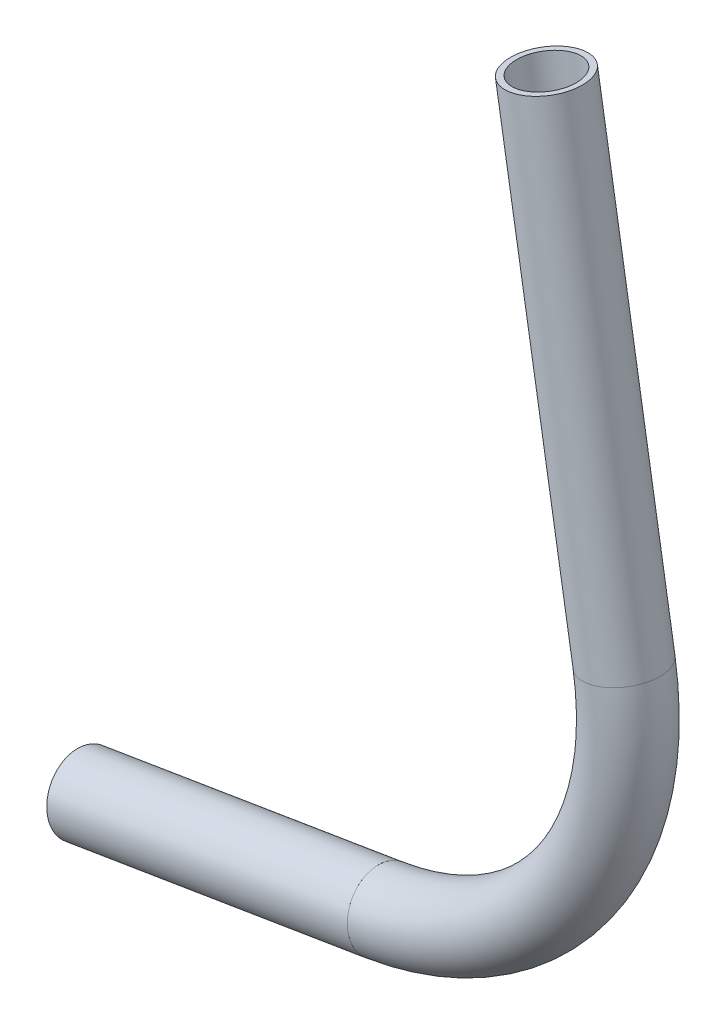
ISO-10303-21;
HEADER;
FILE_DESCRIPTION(('STEP AP214'),'2;1');
FILE_NAME('part.step','',(''),(''),'','','');
FILE_SCHEMA(('AUTOMOTIVE_DESIGN { 1 0 10303 214 1 1 1 1 }'));
ENDSEC;
DATA;
#1=APPLICATION_CONTEXT('core data for automotive mechanical design processes');
#2=APPLICATION_PROTOCOL_DEFINITION('international standard','automotive_design',2000,#1);
#3=PRODUCT_CONTEXT('',#1,'mechanical');
#4=PRODUCT('Part','Part','',(#3));
#5=PRODUCT_RELATED_PRODUCT_CATEGORY('part','',(#4));
#6=PRODUCT_DEFINITION_FORMATION('','',#4);
#7=PRODUCT_DEFINITION_CONTEXT('part definition',#1,'design');
#8=PRODUCT_DEFINITION('design','',#6,#7);
#9=PRODUCT_DEFINITION_SHAPE('','',#8);
#10=(LENGTH_UNIT() NAMED_UNIT(*) SI_UNIT(.MILLI.,.METRE.));
#11=(NAMED_UNIT(*) PLANE_ANGLE_UNIT() SI_UNIT($,.RADIAN.));
#12=(NAMED_UNIT(*) SI_UNIT($,.STERADIAN.) SOLID_ANGLE_UNIT());
#13=UNCERTAINTY_MEASURE_WITH_UNIT(LENGTH_MEASURE(1.E-05),#10,'distance_accuracy_value','');
#14=(GEOMETRIC_REPRESENTATION_CONTEXT(3) GLOBAL_UNCERTAINTY_ASSIGNED_CONTEXT((#13)) GLOBAL_UNIT_ASSIGNED_CONTEXT((#10,
#11,#12)) REPRESENTATION_CONTEXT('',''));
#15=CARTESIAN_POINT('',(0.,0.,0.));
#16=DIRECTION('',(0.,0.,1.));
#17=DIRECTION('',(1.,0.,0.));
#18=AXIS2_PLACEMENT_3D('',#15,#16,#17);
#19=CARTESIAN_POINT('',(152.119261375843,641.808809150247,0.));
#20=DIRECTION('',(-0.986819695995303,-0.161823631141246,0.));
#21=DIRECTION('',(0.161823631141246,-0.986819695995303,0.));
#22=AXIS2_PLACEMENT_3D('',#19,#20,#21);
#23=CYLINDRICAL_SURFACE('',#22,5.28320000000002);
#24=CARTESIAN_POINT('',(99.6262267896413,633.200738698436,0.));
#25=DIRECTION('',(0.986819695995303,0.161823631141246,0.));
#26=DIRECTION('',(-0.161823631141246,0.986819695995303,0.));
#27=AXIS2_PLACEMENT_3D('',#24,#25,#26);
#28=CIRCLE('',#27,5.28320000000002);
#29=CARTESIAN_POINT('',(98.7712801815959,638.414304516318,0.));
#30=VERTEX_POINT('',#29);
#31=EDGE_CURVE('E54',#30,#30,#28,.T.);
#32=ORIENTED_EDGE('',*,*,#31,.F.);
#33=EDGE_LOOP('',(#32));
#34=FACE_BOUND('',#33,.T.);
#35=CARTESIAN_POINT('',(152.119261375843,641.808809150247,0.));
#36=DIRECTION('',(0.986819695995303,0.161823631141246,0.));
#37=DIRECTION('',(-0.161823631141246,0.986819695995303,0.));
#38=AXIS2_PLACEMENT_3D('',#35,#36,#37);
#39=CIRCLE('',#38,5.28320000000002);
#40=CARTESIAN_POINT('',(151.264314767798,647.022374968129,0.));
#41=VERTEX_POINT('',#40);
#42=EDGE_CURVE('E50',#41,#41,#39,.T.);
#43=ORIENTED_EDGE('',*,*,#42,.T.);
#44=EDGE_LOOP('',(#43));
#45=FACE_BOUND('',#44,.T.);
#46=ADVANCED_FACE('F46',(#34,#45),#23,.F.);
#47=CARTESIAN_POINT('',(152.119261375843,641.808809150247,0.));
#48=DIRECTION('',(-0.986819695995303,-0.161823631141246,0.));
#49=DIRECTION('',(0.161823631141246,-0.986819695995303,0.));
#50=AXIS2_PLACEMENT_3D('',#47,#48,#49);
#51=CYLINDRICAL_SURFACE('',#50,6.35);
#52=CARTESIAN_POINT('',(99.6262267896413,633.200738698436,0.));
#53=DIRECTION('',(0.986819695995303,0.161823631141246,0.));
#54=DIRECTION('',(-0.161823631141246,0.986819695995303,0.));
#55=AXIS2_PLACEMENT_3D('',#52,#53,#54);
#56=CIRCLE('',#55,6.35);
#57=CARTESIAN_POINT('',(98.5986467318944,639.467043768006,0.));
#58=VERTEX_POINT('',#57);
#59=EDGE_CURVE('E58',#58,#58,#56,.T.);
#60=ORIENTED_EDGE('',*,*,#59,.T.);
#61=EDGE_LOOP('',(#60));
#62=FACE_BOUND('',#61,.T.);
#63=CARTESIAN_POINT('',(152.119261375843,641.808809150247,0.));
#64=DIRECTION('',(0.986819695995303,0.161823631141246,0.));
#65=DIRECTION('',(-0.161823631141246,0.986819695995303,0.));
#66=AXIS2_PLACEMENT_3D('',#63,#64,#65);
#67=CIRCLE('',#66,6.35);
#68=CARTESIAN_POINT('',(151.091681318096,648.075114219817,0.));
#69=VERTEX_POINT('',#68);
#70=EDGE_CURVE('E12',#69,#69,#67,.T.);
#71=ORIENTED_EDGE('',*,*,#70,.F.);
#72=EDGE_LOOP('',(#71));
#73=FACE_BOUND('',#72,.T.);
#74=ADVANCED_FACE('F73',(#62,#73),#51,.T.);
#75=CARTESIAN_POINT('',(99.6262267896413,633.200738698436,0.));
#76=DIRECTION('',(0.986819695995303,0.161823631141246,0.));
#77=DIRECTION('',(-0.161823631141246,0.986819695995303,0.));
#78=AXIS2_PLACEMENT_3D('',#75,#76,#77);
#79=PLANE('',#78);
#80=ORIENTED_EDGE('',*,*,#31,.T.);
#81=EDGE_LOOP('',(#80));
#82=FACE_BOUND('',#81,.T.);
#83=ORIENTED_EDGE('',*,*,#59,.F.);
#84=EDGE_LOOP('',(#83));
#85=FACE_BOUND('',#84,.T.);
#86=ADVANCED_FACE('F69',(#82,#85),#79,.F.);
#87=CARTESIAN_POINT('',(152.119261375843,641.808809150247,0.));
#88=DIRECTION('',(0.986819695995303,0.161823631141246,0.));
#89=DIRECTION('',(-0.161823631141246,0.986819695995303,0.));
#90=AXIS2_PLACEMENT_3D('',#87,#88,#89);
#91=PLANE('',#90);
#92=ORIENTED_EDGE('',*,*,#42,.F.);
#93=EDGE_LOOP('',(#92));
#94=FACE_BOUND('',#93,.T.);
#95=ORIENTED_EDGE('',*,*,#70,.T.);
#96=EDGE_LOOP('',(#95));
#97=FACE_BOUND('',#96,.T.);
#98=ADVANCED_FACE('F48',(#94,#97),#91,.T.);
#99=CLOSED_SHELL('',(#46,#74,#86,#98));
#100=MANIFOLD_SOLID_BREP('B2',#99);
#101=CARTESIAN_POINT('',(143.898620913868,691.939249706808,0.));
#102=DIRECTION('',(0.,0.,-1.));
#103=DIRECTION('',(-1.,0.,0.));
#104=AXIS2_PLACEMENT_3D('',#101,#102,#103);
#105=TOROIDAL_SURFACE('',#104,50.7999999999998,5.28320000000002);
#106=CARTESIAN_POINT('',(194.029061470429,700.159890168784,0.));
#107=DIRECTION('',(-0.161823631141257,0.986819695995301,0.));
#108=DIRECTION('',(-0.986819695995301,-0.161823631141257,0.));
#109=AXIS2_PLACEMENT_3D('',#106,#107,#108);
#110=CIRCLE('',#109,5.28320000000002);
#111=CARTESIAN_POINT('',(199.242627288312,701.014836776829,0.));
#112=VERTEX_POINT('',#111);
#113=EDGE_CURVE('E149',#112,#112,#110,.T.);
#114=CARTESIAN_POINT('',(152.119261375843,641.808809150247,0.));
#115=DIRECTION('',(-0.986819695995303,-0.161823631141246,0.));
#116=DIRECTION('',(0.161823631141246,-0.986819695995303,0.));
#117=AXIS2_PLACEMENT_3D('',#114,#115,#116);
#118=CIRCLE('',#117,5.28320000000002);
#119=CARTESIAN_POINT('',(152.974207983889,636.595243332364,0.));
#120=VERTEX_POINT('',#119);
#121=EDGE_CURVE('E139',#120,#120,#118,.T.);
#122=CARTESIAN_POINT('',(143.898620913868,691.939249706808,0.));
#123=DIRECTION('',(0.,0.,-1.));
#124=DIRECTION('',(-1.,0.,0.));
#125=AXIS2_PLACEMENT_3D('',#122,#123,#124);
#126=CIRCLE('',#125,56.0831999999998);
#127=EDGE_CURVE('',#112,#120,#126,.T.);
#128=ORIENTED_EDGE('',*,*,#113,.T.);
#129=ORIENTED_EDGE('',*,*,#121,.T.);
#130=ORIENTED_EDGE('',*,*,#127,.T.);
#131=ORIENTED_EDGE('',*,*,#127,.F.);
#132=EDGE_LOOP('',(#128,#130,#129,#131));
#133=FACE_BOUND('',#132,.T.);
#134=ADVANCED_FACE('F135',(#133),#105,.F.);
#135=CARTESIAN_POINT('',(143.898620913868,691.939249706808,0.));
#136=DIRECTION('',(0.,0.,-1.));
#137=DIRECTION('',(-1.,0.,0.));
#138=AXIS2_PLACEMENT_3D('',#135,#136,#137);
#139=TOROIDAL_SURFACE('',#138,50.7999999999998,6.35);
#140=CARTESIAN_POINT('',(194.029061470429,700.159890168784,0.));
#141=DIRECTION('',(-0.161823631141257,0.986819695995301,0.));
#142=DIRECTION('',(-0.986819695995301,-0.161823631141257,0.));
#143=AXIS2_PLACEMENT_3D('',#140,#141,#142);
#144=CIRCLE('',#143,6.35);
#145=CARTESIAN_POINT('',(200.295366539999,701.187470226531,0.));
#146=VERTEX_POINT('',#145);
#147=EDGE_CURVE('E143',#146,#146,#144,.T.);
#148=CARTESIAN_POINT('',(152.119261375843,641.808809150247,0.));
#149=DIRECTION('',(-0.986819695995303,-0.161823631141246,0.));
#150=DIRECTION('',(0.161823631141246,-0.986819695995303,0.));
#151=AXIS2_PLACEMENT_3D('',#148,#149,#150);
#152=CIRCLE('',#151,6.35);
#153=CARTESIAN_POINT('',(153.14684143359,635.542504080677,0.));
#154=VERTEX_POINT('',#153);
#155=EDGE_CURVE('E45',#154,#154,#152,.T.);
#156=CARTESIAN_POINT('',(143.898620913868,691.939249706808,0.));
#157=DIRECTION('',(0.,0.,-1.));
#158=DIRECTION('',(-1.,0.,0.));
#159=AXIS2_PLACEMENT_3D('',#156,#157,#158);
#160=CIRCLE('',#159,57.1499999999998);
#161=EDGE_CURVE('',#146,#154,#160,.T.);
#162=ORIENTED_EDGE('',*,*,#147,.F.);
#163=ORIENTED_EDGE('',*,*,#155,.F.);
#164=ORIENTED_EDGE('',*,*,#161,.T.);
#165=ORIENTED_EDGE('',*,*,#161,.F.);
#166=EDGE_LOOP('',(#162,#164,#163,#165));
#167=FACE_BOUND('',#166,.T.);
#168=ADVANCED_FACE('F162',(#167),#139,.T.);
#169=CARTESIAN_POINT('',(194.029061470429,700.159890168784,0.));
#170=DIRECTION('',(-0.161823631141257,0.986819695995301,0.));
#171=DIRECTION('',(-0.986819695995301,-0.161823631141257,0.));
#172=AXIS2_PLACEMENT_3D('',#169,#170,#171);
#173=PLANE('',#172);
#174=ORIENTED_EDGE('',*,*,#113,.F.);
#175=EDGE_LOOP('',(#174));
#176=FACE_BOUND('',#175,.T.);
#177=ORIENTED_EDGE('',*,*,#147,.T.);
#178=EDGE_LOOP('',(#177));
#179=FACE_BOUND('',#178,.T.);
#180=ADVANCED_FACE('F158',(#176,#179),#173,.T.);
#181=CARTESIAN_POINT('',(152.119261375843,641.808809150247,0.));
#182=DIRECTION('',(-0.986819695995303,-0.161823631141246,0.));
#183=DIRECTION('',(0.161823631141246,-0.986819695995303,0.));
#184=AXIS2_PLACEMENT_3D('',#181,#182,#183);
#185=PLANE('',#184);
#186=ORIENTED_EDGE('',*,*,#121,.F.);
#187=EDGE_LOOP('',(#186));
#188=FACE_BOUND('',#187,.T.);
#189=ORIENTED_EDGE('',*,*,#155,.T.);
#190=EDGE_LOOP('',(#189));
#191=FACE_BOUND('',#190,.T.);
#192=ADVANCED_FACE('F137',(#188,#191),#185,.T.);
#193=CLOSED_SHELL('',(#134,#168,#180,#192));
#194=MANIFOLD_SOLID_BREP('B7',#193);
#195=CARTESIAN_POINT('',(180.471005918546,782.838520994454,0.));
#196=DIRECTION('',(0.161823631141249,-0.986819695995302,0.));
#197=DIRECTION('',(0.986819695995302,0.161823631141249,0.));
#198=AXIS2_PLACEMENT_3D('',#195,#196,#197);
#199=CYLINDRICAL_SURFACE('',#198,5.28320000000002);
#200=CARTESIAN_POINT('',(180.471005918546,782.838520994454,0.));
#201=DIRECTION('',(-0.161823631141257,0.986819695995301,0.));
#202=DIRECTION('',(-0.986819695995301,-0.161823631141257,0.));
#203=AXIS2_PLACEMENT_3D('',#200,#201,#202);
#204=CIRCLE('',#203,5.28320000000002);
#205=CARTESIAN_POINT('',(175.257440100664,781.983574386408,0.));
#206=VERTEX_POINT('',#205);
#207=EDGE_CURVE('E233',#206,#206,#204,.T.);
#208=ORIENTED_EDGE('',*,*,#207,.T.);
#209=EDGE_LOOP('',(#208));
#210=FACE_BOUND('',#209,.T.);
#211=CARTESIAN_POINT('',(194.029061470429,700.159890168784,0.));
#212=DIRECTION('',(0.161823631141257,-0.986819695995301,0.));
#213=DIRECTION('',(0.986819695995301,0.161823631141257,0.));
#214=AXIS2_PLACEMENT_3D('',#211,#212,#213);
#215=CIRCLE('',#214,5.28320000000002);
#216=CARTESIAN_POINT('',(199.242627288312,701.014836776829,0.));
#217=VERTEX_POINT('',#216);
#218=EDGE_CURVE('E223',#217,#217,#215,.T.);
#219=ORIENTED_EDGE('',*,*,#218,.T.);
#220=EDGE_LOOP('',(#219));
#221=FACE_BOUND('',#220,.T.);
#222=ADVANCED_FACE('F219',(#210,#221),#199,.F.);
#223=CARTESIAN_POINT('',(180.471005918546,782.838520994454,0.));
#224=DIRECTION('',(0.161823631141249,-0.986819695995302,0.));
#225=DIRECTION('',(0.986819695995302,0.161823631141249,0.));
#226=AXIS2_PLACEMENT_3D('',#223,#224,#225);
#227=CYLINDRICAL_SURFACE('',#226,6.35);
#228=CARTESIAN_POINT('',(180.471005918546,782.838520994454,0.));
#229=DIRECTION('',(-0.161823631141257,0.986819695995301,0.));
#230=DIRECTION('',(-0.986819695995301,-0.161823631141257,0.));
#231=AXIS2_PLACEMENT_3D('',#228,#229,#230);
#232=CIRCLE('',#231,6.35);
#233=CARTESIAN_POINT('',(174.204700848976,781.810940936707,0.));
#234=VERTEX_POINT('',#233);
#235=EDGE_CURVE('E227',#234,#234,#232,.T.);
#236=ORIENTED_EDGE('',*,*,#235,.F.);
#237=EDGE_LOOP('',(#236));
#238=FACE_BOUND('',#237,.T.);
#239=CARTESIAN_POINT('',(194.029061470429,700.159890168784,0.));
#240=DIRECTION('',(0.161823631141257,-0.986819695995301,0.));
#241=DIRECTION('',(0.986819695995301,0.161823631141257,0.));
#242=AXIS2_PLACEMENT_3D('',#239,#240,#241);
#243=CIRCLE('',#242,6.35);
#244=CARTESIAN_POINT('',(200.295366539999,701.187470226531,0.));
#245=VERTEX_POINT('',#244);
#246=EDGE_CURVE('E134',#245,#245,#243,.T.);
#247=ORIENTED_EDGE('',*,*,#246,.F.);
#248=EDGE_LOOP('',(#247));
#249=FACE_BOUND('',#248,.T.);
#250=ADVANCED_FACE('F246',(#238,#249),#227,.T.);
#251=CARTESIAN_POINT('',(180.471005918546,782.838520994454,0.));
#252=DIRECTION('',(-0.161823631141257,0.986819695995301,0.));
#253=DIRECTION('',(-0.986819695995301,-0.161823631141257,0.));
#254=AXIS2_PLACEMENT_3D('',#251,#252,#253);
#255=PLANE('',#254);
#256=ORIENTED_EDGE('',*,*,#207,.F.);
#257=EDGE_LOOP('',(#256));
#258=FACE_BOUND('',#257,.T.);
#259=ORIENTED_EDGE('',*,*,#235,.T.);
#260=EDGE_LOOP('',(#259));
#261=FACE_BOUND('',#260,.T.);
#262=ADVANCED_FACE('F242',(#258,#261),#255,.T.);
#263=CARTESIAN_POINT('',(194.029061470429,700.159890168784,0.));
#264=DIRECTION('',(0.161823631141257,-0.986819695995301,0.));
#265=DIRECTION('',(0.986819695995301,0.161823631141257,0.));
#266=AXIS2_PLACEMENT_3D('',#263,#264,#265);
#267=PLANE('',#266);
#268=ORIENTED_EDGE('',*,*,#218,.F.);
#269=EDGE_LOOP('',(#268));
#270=FACE_BOUND('',#269,.T.);
#271=ORIENTED_EDGE('',*,*,#246,.T.);
#272=EDGE_LOOP('',(#271));
#273=FACE_BOUND('',#272,.T.);
#274=ADVANCED_FACE('F221',(#270,#273),#267,.T.);
#275=CLOSED_SHELL('',(#222,#250,#262,#274));
#276=MANIFOLD_SOLID_BREP('B40',#275);
#277=ADVANCED_BREP_SHAPE_REPRESENTATION('',(#18,#100,#194,#276),#14);
#278=SHAPE_DEFINITION_REPRESENTATION(#9,#277);
ENDSEC;
END-ISO-10303-21;
